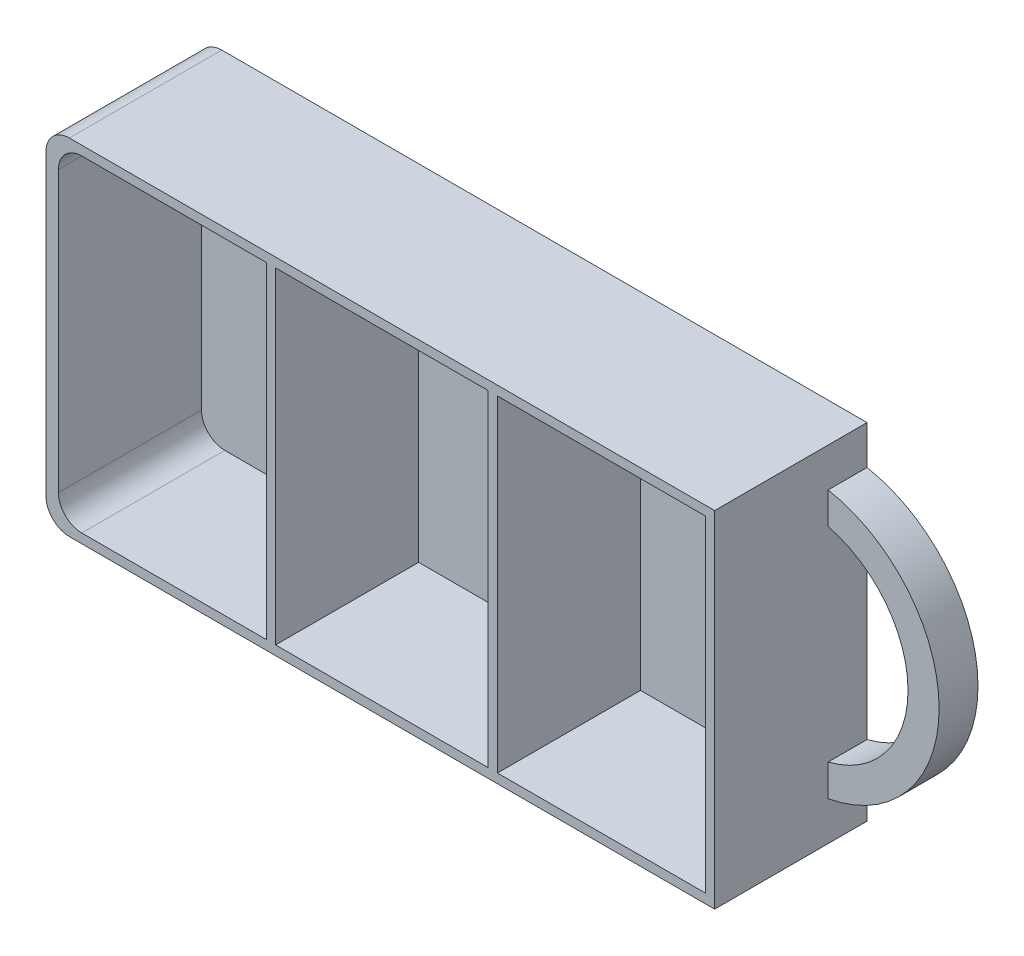
ISO-10303-21;
HEADER;
FILE_DESCRIPTION(('STEP AP214'),'2;1');
FILE_NAME('part.step','',(''),(''),'','','');
FILE_SCHEMA(('AUTOMOTIVE_DESIGN { 1 0 10303 214 1 1 1 1 }'));
ENDSEC;
DATA;
#1=APPLICATION_CONTEXT('core data for automotive mechanical design processes');
#2=APPLICATION_PROTOCOL_DEFINITION('international standard','automotive_design',2000,#1);
#3=PRODUCT_CONTEXT('',#1,'mechanical');
#4=PRODUCT('Part','Part','',(#3));
#5=PRODUCT_RELATED_PRODUCT_CATEGORY('part','',(#4));
#6=PRODUCT_DEFINITION_FORMATION('','',#4);
#7=PRODUCT_DEFINITION_CONTEXT('part definition',#1,'design');
#8=PRODUCT_DEFINITION('design','',#6,#7);
#9=PRODUCT_DEFINITION_SHAPE('','',#8);
#10=(LENGTH_UNIT() NAMED_UNIT(*) SI_UNIT(.MILLI.,.METRE.));
#11=(NAMED_UNIT(*) PLANE_ANGLE_UNIT() SI_UNIT($,.RADIAN.));
#12=(NAMED_UNIT(*) SI_UNIT($,.STERADIAN.) SOLID_ANGLE_UNIT());
#13=UNCERTAINTY_MEASURE_WITH_UNIT(LENGTH_MEASURE(1.E-05),#10,'distance_accuracy_value','');
#14=(GEOMETRIC_REPRESENTATION_CONTEXT(3) GLOBAL_UNCERTAINTY_ASSIGNED_CONTEXT((#13)) GLOBAL_UNIT_ASSIGNED_CONTEXT((#10,
#11,#12)) REPRESENTATION_CONTEXT('',''));
#15=CARTESIAN_POINT('',(0.,0.,0.));
#16=DIRECTION('',(0.,0.,1.));
#17=DIRECTION('',(1.,0.,0.));
#18=AXIS2_PLACEMENT_3D('',#15,#16,#17);
#19=CARTESIAN_POINT('',(0.,0.,19.6));
#20=DIRECTION('',(0.,0.,1.));
#21=DIRECTION('',(1.,0.,0.));
#22=AXIS2_PLACEMENT_3D('',#19,#20,#21);
#23=PLANE('',#22);
#24=DIRECTION('',(-1.,0.,0.));
#25=VECTOR('',#24,1.);
#26=CARTESIAN_POINT('',(0.,21.,19.6));
#27=LINE('',#26,#25);
#28=CARTESIAN_POINT('',(-14.6666666666667,21.,19.6));
#29=VERTEX_POINT('',#28);
#30=CARTESIAN_POINT('',(-38.4,21.,19.6));
#31=VERTEX_POINT('',#30);
#32=EDGE_CURVE('E227',#29,#31,#27,.T.);
#33=ORIENTED_EDGE('',*,*,#32,.F.);
#34=DIRECTION('',(0.,1.,0.));
#35=VECTOR('',#34,1.);
#36=CARTESIAN_POINT('',(-14.6666666666667,0.,19.6));
#37=LINE('',#36,#35);
#38=CARTESIAN_POINT('',(-14.6666666666667,-21.,19.6));
#39=VERTEX_POINT('',#38);
#40=EDGE_CURVE('E213',#39,#29,#37,.T.);
#41=ORIENTED_EDGE('',*,*,#40,.F.);
#42=DIRECTION('',(1.,0.,0.));
#43=VECTOR('',#42,1.);
#44=CARTESIAN_POINT('',(0.,-21.,19.6));
#45=LINE('',#44,#43);
#46=CARTESIAN_POINT('',(-38.4,-21.,19.6));
#47=VERTEX_POINT('',#46);
#48=EDGE_CURVE('E204',#47,#39,#45,.T.);
#49=ORIENTED_EDGE('',*,*,#48,.F.);
#50=CARTESIAN_POINT('',(-38.4,-18.,19.6));
#51=DIRECTION('',(0.,0.,1.));
#52=DIRECTION('',(1.,0.,0.));
#53=AXIS2_PLACEMENT_3D('',#50,#51,#52);
#54=CIRCLE('',#53,3.);
#55=CARTESIAN_POINT('',(-41.4,-18.,19.6));
#56=VERTEX_POINT('',#55);
#57=EDGE_CURVE('E49',#47,#56,#54,.F.);
#58=ORIENTED_EDGE('',*,*,#57,.T.);
#59=DIRECTION('',(0.,-1.,0.));
#60=VECTOR('',#59,1.);
#61=CARTESIAN_POINT('',(-41.4,0.,19.6));
#62=LINE('',#61,#60);
#63=CARTESIAN_POINT('',(-41.4,18.,19.6));
#64=VERTEX_POINT('',#63);
#65=EDGE_CURVE('E214',#64,#56,#62,.T.);
#66=ORIENTED_EDGE('',*,*,#65,.F.);
#67=CARTESIAN_POINT('',(-38.4,18.,19.6));
#68=DIRECTION('',(0.,0.,1.));
#69=DIRECTION('',(1.,0.,0.));
#70=AXIS2_PLACEMENT_3D('',#67,#68,#69);
#71=CIRCLE('',#70,3.);
#72=EDGE_CURVE('E12',#64,#31,#71,.F.);
#73=ORIENTED_EDGE('',*,*,#72,.T.);
#74=EDGE_LOOP('',(#33,#41,#49,#58,#66,#73));
#75=FACE_BOUND('',#74,.T.);
#76=DIRECTION('',(-1.,0.,0.));
#77=VECTOR('',#76,1.);
#78=CARTESIAN_POINT('',(0.,21.,19.6));
#79=LINE('',#78,#77);
#80=CARTESIAN_POINT('',(41.8,21.,19.6));
#81=VERTEX_POINT('',#80);
#82=CARTESIAN_POINT('',(15.0666666666667,21.,19.6));
#83=VERTEX_POINT('',#82);
#84=EDGE_CURVE('E276',#81,#83,#79,.T.);
#85=ORIENTED_EDGE('',*,*,#84,.F.);
#86=DIRECTION('',(0.,1.,0.));
#87=VECTOR('',#86,1.);
#88=CARTESIAN_POINT('',(41.8,0.,19.6));
#89=LINE('',#88,#87);
#90=CARTESIAN_POINT('',(41.8,-21.,19.6));
#91=VERTEX_POINT('',#90);
#92=EDGE_CURVE('E284',#91,#81,#89,.T.);
#93=ORIENTED_EDGE('',*,*,#92,.F.);
#94=DIRECTION('',(1.,0.,0.));
#95=VECTOR('',#94,1.);
#96=CARTESIAN_POINT('',(0.,-21.,19.6));
#97=LINE('',#96,#95);
#98=CARTESIAN_POINT('',(15.0666666666667,-21.,19.6));
#99=VERTEX_POINT('',#98);
#100=EDGE_CURVE('E281',#99,#91,#97,.T.);
#101=ORIENTED_EDGE('',*,*,#100,.F.);
#102=DIRECTION('',(0.,-1.,0.));
#103=VECTOR('',#102,1.);
#104=CARTESIAN_POINT('',(15.0666666666667,0.,19.6));
#105=LINE('',#104,#103);
#106=EDGE_CURVE('E278',#83,#99,#105,.T.);
#107=ORIENTED_EDGE('',*,*,#106,.F.);
#108=EDGE_LOOP('',(#85,#93,#101,#107));
#109=FACE_BOUND('',#108,.T.);
#110=DIRECTION('',(-1.,0.,0.));
#111=VECTOR('',#110,1.);
#112=CARTESIAN_POINT('',(-43.,22.2,19.6));
#113=LINE('',#112,#111);
#114=CARTESIAN_POINT('',(43.,22.2,19.6));
#115=VERTEX_POINT('',#114);
#116=CARTESIAN_POINT('',(-40.,22.2,19.6));
#117=VERTEX_POINT('',#116);
#118=EDGE_CURVE('E329',#115,#117,#113,.T.);
#119=ORIENTED_EDGE('',*,*,#118,.T.);
#120=CARTESIAN_POINT('',(-40.,19.2,19.6));
#121=DIRECTION('',(0.,0.,1.));
#122=DIRECTION('',(1.,0.,0.));
#123=AXIS2_PLACEMENT_3D('',#120,#121,#122);
#124=CIRCLE('',#123,3.);
#125=CARTESIAN_POINT('',(-43.,19.2,19.6));
#126=VERTEX_POINT('',#125);
#127=EDGE_CURVE('E367',#117,#126,#124,.T.);
#128=ORIENTED_EDGE('',*,*,#127,.T.);
#129=DIRECTION('',(0.,-1.,0.));
#130=VECTOR('',#129,1.);
#131=CARTESIAN_POINT('',(-43.,22.2,19.6));
#132=LINE('',#131,#130);
#133=CARTESIAN_POINT('',(-43.,-19.2,19.6));
#134=VERTEX_POINT('',#133);
#135=EDGE_CURVE('E333',#126,#134,#132,.T.);
#136=ORIENTED_EDGE('',*,*,#135,.T.);
#137=CARTESIAN_POINT('',(-40.,-19.2,19.6));
#138=DIRECTION('',(0.,0.,1.));
#139=DIRECTION('',(1.,0.,0.));
#140=AXIS2_PLACEMENT_3D('',#137,#138,#139);
#141=CIRCLE('',#140,3.);
#142=CARTESIAN_POINT('',(-40.,-22.2,19.6));
#143=VERTEX_POINT('',#142);
#144=EDGE_CURVE('E365',#134,#143,#141,.T.);
#145=ORIENTED_EDGE('',*,*,#144,.T.);
#146=DIRECTION('',(1.,0.,0.));
#147=VECTOR('',#146,1.);
#148=CARTESIAN_POINT('',(-43.,-22.2,19.6));
#149=LINE('',#148,#147);
#150=CARTESIAN_POINT('',(43.,-22.2,19.6));
#151=VERTEX_POINT('',#150);
#152=EDGE_CURVE('E336',#143,#151,#149,.T.);
#153=ORIENTED_EDGE('',*,*,#152,.T.);
#154=DIRECTION('',(0.,1.,0.));
#155=VECTOR('',#154,1.);
#156=CARTESIAN_POINT('',(43.,22.2,19.6));
#157=LINE('',#156,#155);
#158=EDGE_CURVE('E326',#151,#115,#157,.T.);
#159=ORIENTED_EDGE('',*,*,#158,.T.);
#160=EDGE_LOOP('',(#119,#128,#136,#145,#153,#159));
#161=FACE_BOUND('',#160,.T.);
#162=DIRECTION('',(-1.,0.,0.));
#163=VECTOR('',#162,1.);
#164=CARTESIAN_POINT('',(0.,21.,19.6));
#165=LINE('',#164,#163);
#166=CARTESIAN_POINT('',(13.8666666666667,21.,19.6));
#167=VERTEX_POINT('',#166);
#168=CARTESIAN_POINT('',(-13.4666666666667,21.,19.6));
#169=VERTEX_POINT('',#168);
#170=EDGE_CURVE('E250',#167,#169,#165,.T.);
#171=ORIENTED_EDGE('',*,*,#170,.F.);
#172=DIRECTION('',(0.,-1.,0.));
#173=VECTOR('',#172,1.);
#174=CARTESIAN_POINT('',(13.8666666666667,0.,19.6));
#175=LINE('',#174,#173);
#176=CARTESIAN_POINT('',(13.8666666666667,-21.,19.6));
#177=VERTEX_POINT('',#176);
#178=EDGE_CURVE('E247',#167,#177,#175,.T.);
#179=ORIENTED_EDGE('',*,*,#178,.T.);
#180=DIRECTION('',(1.,0.,0.));
#181=VECTOR('',#180,1.);
#182=CARTESIAN_POINT('',(0.,-21.,19.6));
#183=LINE('',#182,#181);
#184=CARTESIAN_POINT('',(-13.4666666666667,-21.,19.6));
#185=VERTEX_POINT('',#184);
#186=EDGE_CURVE('E257',#185,#177,#183,.T.);
#187=ORIENTED_EDGE('',*,*,#186,.F.);
#188=DIRECTION('',(0.,1.,0.));
#189=VECTOR('',#188,1.);
#190=CARTESIAN_POINT('',(-13.4666666666667,0.,19.6));
#191=LINE('',#190,#189);
#192=EDGE_CURVE('E254',#185,#169,#191,.T.);
#193=ORIENTED_EDGE('',*,*,#192,.T.);
#194=EDGE_LOOP('',(#171,#179,#187,#193));
#195=FACE_BOUND('',#194,.T.);
#196=ADVANCED_FACE('F41',(#75,#109,#161,#195),#23,.T.);
#197=CARTESIAN_POINT('',(43.,22.2,19.6));
#198=DIRECTION('',(-1.,0.,0.));
#199=DIRECTION('',(0.,-1.,0.));
#200=AXIS2_PLACEMENT_3D('',#197,#198,#199);
#201=PLANE('',#200);
#202=DIRECTION('',(0.,0.,-1.));
#203=VECTOR('',#202,1.);
#204=CARTESIAN_POINT('',(43.,-17.2,5.));
#205=LINE('',#204,#203);
#206=CARTESIAN_POINT('',(43.,-17.2,5.));
#207=VERTEX_POINT('',#206);
#208=CARTESIAN_POINT('',(43.,-17.2,0.));
#209=VERTEX_POINT('',#208);
#210=EDGE_CURVE('E309',#207,#209,#205,.T.);
#211=ORIENTED_EDGE('',*,*,#210,.F.);
#212=DIRECTION('',(0.,-1.,0.));
#213=VECTOR('',#212,1.);
#214=CARTESIAN_POINT('',(43.,-17.2,5.));
#215=LINE('',#214,#213);
#216=CARTESIAN_POINT('',(43.,-13.1087756865391,5.));
#217=VERTEX_POINT('',#216);
#218=EDGE_CURVE('E306',#217,#207,#215,.T.);
#219=ORIENTED_EDGE('',*,*,#218,.F.);
#220=DIRECTION('',(0.,0.,-1.));
#221=VECTOR('',#220,1.);
#222=CARTESIAN_POINT('',(43.,-13.1087756865391,5.));
#223=LINE('',#222,#221);
#224=CARTESIAN_POINT('',(43.,-13.1087756865391,0.));
#225=VERTEX_POINT('',#224);
#226=EDGE_CURVE('E316',#217,#225,#223,.T.);
#227=ORIENTED_EDGE('',*,*,#226,.T.);
#228=DIRECTION('',(0.,1.,0.));
#229=VECTOR('',#228,1.);
#230=CARTESIAN_POINT('',(43.,22.2,0.));
#231=LINE('',#230,#229);
#232=CARTESIAN_POINT('',(43.,13.1087756865391,0.));
#233=VERTEX_POINT('',#232);
#234=EDGE_CURVE('E342',#225,#233,#231,.T.);
#235=ORIENTED_EDGE('',*,*,#234,.T.);
#236=DIRECTION('',(0.,0.,-1.));
#237=VECTOR('',#236,1.);
#238=CARTESIAN_POINT('',(43.,13.1087756865391,5.));
#239=LINE('',#238,#237);
#240=CARTESIAN_POINT('',(43.,13.1087756865391,5.));
#241=VERTEX_POINT('',#240);
#242=EDGE_CURVE('E319',#241,#233,#239,.T.);
#243=ORIENTED_EDGE('',*,*,#242,.F.);
#244=DIRECTION('',(0.,-1.,0.));
#245=VECTOR('',#244,1.);
#246=CARTESIAN_POINT('',(43.,17.2,5.));
#247=LINE('',#246,#245);
#248=CARTESIAN_POINT('',(43.,17.2,5.));
#249=VERTEX_POINT('',#248);
#250=EDGE_CURVE('E299',#249,#241,#247,.T.);
#251=ORIENTED_EDGE('',*,*,#250,.F.);
#252=DIRECTION('',(0.,0.,-1.));
#253=VECTOR('',#252,1.);
#254=CARTESIAN_POINT('',(43.,17.2,5.));
#255=LINE('',#254,#253);
#256=CARTESIAN_POINT('',(43.,17.2,0.));
#257=VERTEX_POINT('',#256);
#258=EDGE_CURVE('E322',#249,#257,#255,.T.);
#259=ORIENTED_EDGE('',*,*,#258,.T.);
#260=CARTESIAN_POINT('',(43.,22.2,0.));
#261=VERTEX_POINT('',#260);
#262=EDGE_CURVE('E325',#257,#261,#231,.T.);
#263=ORIENTED_EDGE('',*,*,#262,.T.);
#264=DIRECTION('',(0.,0.,-1.));
#265=VECTOR('',#264,1.);
#266=CARTESIAN_POINT('',(43.,22.2,19.6));
#267=LINE('',#266,#265);
#268=EDGE_CURVE('E351',#115,#261,#267,.T.);
#269=ORIENTED_EDGE('',*,*,#268,.F.);
#270=ORIENTED_EDGE('',*,*,#158,.F.);
#271=DIRECTION('',(0.,0.,-1.));
#272=VECTOR('',#271,1.);
#273=CARTESIAN_POINT('',(43.,-22.2,19.6));
#274=LINE('',#273,#272);
#275=CARTESIAN_POINT('',(43.,-22.2,0.));
#276=VERTEX_POINT('',#275);
#277=EDGE_CURVE('E338',#151,#276,#274,.T.);
#278=ORIENTED_EDGE('',*,*,#277,.T.);
#279=EDGE_CURVE('E339',#276,#209,#231,.T.);
#280=ORIENTED_EDGE('',*,*,#279,.T.);
#281=EDGE_LOOP('',(#211,#219,#227,#235,#243,#251,#259,#263,#269,#270,#278,#280));
#282=FACE_BOUND('',#281,.T.);
#283=ADVANCED_FACE('F403',(#282),#201,.F.);
#284=CARTESIAN_POINT('',(-43.,22.2,19.6));
#285=DIRECTION('',(0.,-1.,0.));
#286=DIRECTION('',(0.,0.,-1.));
#287=AXIS2_PLACEMENT_3D('',#284,#285,#286);
#288=PLANE('',#287);
#289=DIRECTION('',(-1.,0.,0.));
#290=VECTOR('',#289,1.);
#291=CARTESIAN_POINT('',(-43.,22.2,0.));
#292=LINE('',#291,#290);
#293=CARTESIAN_POINT('',(-40.,22.2,0.));
#294=VERTEX_POINT('',#293);
#295=EDGE_CURVE('E341',#261,#294,#292,.T.);
#296=ORIENTED_EDGE('',*,*,#295,.T.);
#297=DIRECTION('',(0.,0.,-1.));
#298=VECTOR('',#297,1.);
#299=CARTESIAN_POINT('',(-40.,22.2,19.6));
#300=LINE('',#299,#298);
#301=EDGE_CURVE('E363',#294,#117,#300,.F.);
#302=ORIENTED_EDGE('',*,*,#301,.T.);
#303=ORIENTED_EDGE('',*,*,#118,.F.);
#304=ORIENTED_EDGE('',*,*,#268,.T.);
#305=EDGE_LOOP('',(#296,#302,#303,#304));
#306=FACE_BOUND('',#305,.T.);
#307=ADVANCED_FACE('F408',(#306),#288,.F.);
#308=CARTESIAN_POINT('',(-43.,22.2,19.6));
#309=DIRECTION('',(1.,0.,0.));
#310=DIRECTION('',(0.,1.,0.));
#311=AXIS2_PLACEMENT_3D('',#308,#309,#310);
#312=PLANE('',#311);
#313=ORIENTED_EDGE('',*,*,#135,.F.);
#314=DIRECTION('',(0.,0.,-1.));
#315=VECTOR('',#314,1.);
#316=CARTESIAN_POINT('',(-43.,19.2,19.6));
#317=LINE('',#316,#315);
#318=CARTESIAN_POINT('',(-43.,19.2,0.));
#319=VERTEX_POINT('',#318);
#320=EDGE_CURVE('E356',#126,#319,#317,.T.);
#321=ORIENTED_EDGE('',*,*,#320,.T.);
#322=DIRECTION('',(0.,-1.,0.));
#323=VECTOR('',#322,1.);
#324=CARTESIAN_POINT('',(-43.,22.2,0.));
#325=LINE('',#324,#323);
#326=CARTESIAN_POINT('',(-43.,-19.2,0.));
#327=VERTEX_POINT('',#326);
#328=EDGE_CURVE('E345',#319,#327,#325,.T.);
#329=ORIENTED_EDGE('',*,*,#328,.T.);
#330=DIRECTION('',(0.,0.,-1.));
#331=VECTOR('',#330,1.);
#332=CARTESIAN_POINT('',(-43.,-19.2,19.6));
#333=LINE('',#332,#331);
#334=EDGE_CURVE('E354',#327,#134,#333,.F.);
#335=ORIENTED_EDGE('',*,*,#334,.T.);
#336=EDGE_LOOP('',(#313,#321,#329,#335));
#337=FACE_BOUND('',#336,.T.);
#338=ADVANCED_FACE('F422',(#337),#312,.F.);
#339=CARTESIAN_POINT('',(-43.,-22.2,19.6));
#340=DIRECTION('',(0.,1.,0.));
#341=DIRECTION('',(0.,0.,1.));
#342=AXIS2_PLACEMENT_3D('',#339,#340,#341);
#343=PLANE('',#342);
#344=ORIENTED_EDGE('',*,*,#152,.F.);
#345=DIRECTION('',(0.,0.,-1.));
#346=VECTOR('',#345,1.);
#347=CARTESIAN_POINT('',(-40.,-22.2,19.6));
#348=LINE('',#347,#346);
#349=CARTESIAN_POINT('',(-40.,-22.2,0.));
#350=VERTEX_POINT('',#349);
#351=EDGE_CURVE('E369',#143,#350,#348,.T.);
#352=ORIENTED_EDGE('',*,*,#351,.T.);
#353=DIRECTION('',(1.,0.,0.));
#354=VECTOR('',#353,1.);
#355=CARTESIAN_POINT('',(-43.,-22.2,0.));
#356=LINE('',#355,#354);
#357=EDGE_CURVE('E330',#350,#276,#356,.T.);
#358=ORIENTED_EDGE('',*,*,#357,.T.);
#359=ORIENTED_EDGE('',*,*,#277,.F.);
#360=EDGE_LOOP('',(#344,#352,#358,#359));
#361=FACE_BOUND('',#360,.T.);
#362=ADVANCED_FACE('F418',(#361),#343,.F.);
#363=CARTESIAN_POINT('',(0.,0.,0.));
#364=DIRECTION('',(0.,0.,1.));
#365=DIRECTION('',(1.,0.,0.));
#366=AXIS2_PLACEMENT_3D('',#363,#364,#365);
#367=PLANE('',#366);
#368=CARTESIAN_POINT('',(39.7735468390197,0.,0.));
#369=DIRECTION('',(0.,0.,-1.));
#370=DIRECTION('',(1.,0.,0.));
#371=AXIS2_PLACEMENT_3D('',#368,#369,#370);
#372=CIRCLE('',#371,13.5);
#373=EDGE_CURVE('E300',#233,#225,#372,.T.);
#374=ORIENTED_EDGE('',*,*,#373,.F.);
#375=ORIENTED_EDGE('',*,*,#234,.F.);
#376=EDGE_LOOP('',(#374,#375));
#377=FACE_BOUND('',#376,.T.);
#378=ORIENTED_EDGE('',*,*,#328,.F.);
#379=CARTESIAN_POINT('',(-40.,19.2,0.));
#380=DIRECTION('',(0.,0.,1.));
#381=DIRECTION('',(1.,0.,0.));
#382=AXIS2_PLACEMENT_3D('',#379,#380,#381);
#383=CIRCLE('',#382,3.);
#384=EDGE_CURVE('E361',#319,#294,#383,.F.);
#385=ORIENTED_EDGE('',*,*,#384,.T.);
#386=ORIENTED_EDGE('',*,*,#295,.F.);
#387=ORIENTED_EDGE('',*,*,#262,.F.);
#388=CARTESIAN_POINT('',(39.7735468390197,0.,0.));
#389=DIRECTION('',(0.,0.,1.));
#390=DIRECTION('',(1.,0.,0.));
#391=AXIS2_PLACEMENT_3D('',#388,#389,#390);
#392=CIRCLE('',#391,17.5);
#393=EDGE_CURVE('E235',#209,#257,#392,.T.);
#394=ORIENTED_EDGE('',*,*,#393,.F.);
#395=ORIENTED_EDGE('',*,*,#279,.F.);
#396=ORIENTED_EDGE('',*,*,#357,.F.);
#397=CARTESIAN_POINT('',(-40.,-19.2,0.));
#398=DIRECTION('',(0.,0.,1.));
#399=DIRECTION('',(1.,0.,0.));
#400=AXIS2_PLACEMENT_3D('',#397,#398,#399);
#401=CIRCLE('',#400,3.);
#402=EDGE_CURVE('E359',#350,#327,#401,.F.);
#403=ORIENTED_EDGE('',*,*,#402,.T.);
#404=EDGE_LOOP('',(#378,#385,#386,#387,#394,#395,#396,#403));
#405=FACE_BOUND('',#404,.T.);
#406=ADVANCED_FACE('F415',(#377,#405),#367,.F.);
#407=CARTESIAN_POINT('',(39.7735468390197,0.,5.));
#408=DIRECTION('',(0.,0.,-1.));
#409=DIRECTION('',(-1.,0.,0.));
#410=AXIS2_PLACEMENT_3D('',#407,#408,#409);
#411=CYLINDRICAL_SURFACE('',#410,17.5);
#412=ORIENTED_EDGE('',*,*,#393,.T.);
#413=ORIENTED_EDGE('',*,*,#258,.F.);
#414=CARTESIAN_POINT('',(39.7735468390197,0.,5.));
#415=DIRECTION('',(0.,0.,1.));
#416=DIRECTION('',(1.,0.,0.));
#417=AXIS2_PLACEMENT_3D('',#414,#415,#416);
#418=CIRCLE('',#417,17.5);
#419=EDGE_CURVE('E296',#207,#249,#418,.T.);
#420=ORIENTED_EDGE('',*,*,#419,.F.);
#421=ORIENTED_EDGE('',*,*,#210,.T.);
#422=EDGE_LOOP('',(#412,#413,#420,#421));
#423=FACE_BOUND('',#422,.T.);
#424=ADVANCED_FACE('F413',(#423),#411,.T.);
#425=CARTESIAN_POINT('',(39.7735468390197,0.,5.));
#426=DIRECTION('',(0.,0.,-1.));
#427=DIRECTION('',(-1.,0.,0.));
#428=AXIS2_PLACEMENT_3D('',#425,#426,#427);
#429=CYLINDRICAL_SURFACE('',#428,13.5);
#430=ORIENTED_EDGE('',*,*,#373,.T.);
#431=ORIENTED_EDGE('',*,*,#226,.F.);
#432=CARTESIAN_POINT('',(39.7735468390197,0.,5.));
#433=DIRECTION('',(0.,0.,-1.));
#434=DIRECTION('',(1.,0.,0.));
#435=AXIS2_PLACEMENT_3D('',#432,#433,#434);
#436=CIRCLE('',#435,13.5);
#437=EDGE_CURVE('E303',#241,#217,#436,.T.);
#438=ORIENTED_EDGE('',*,*,#437,.F.);
#439=ORIENTED_EDGE('',*,*,#242,.T.);
#440=EDGE_LOOP('',(#430,#431,#438,#439));
#441=FACE_BOUND('',#440,.T.);
#442=ADVANCED_FACE('F466',(#441),#429,.F.);
#443=CARTESIAN_POINT('',(39.7735468390197,0.,5.));
#444=DIRECTION('',(0.,0.,1.));
#445=DIRECTION('',(1.,0.,0.));
#446=AXIS2_PLACEMENT_3D('',#443,#444,#445);
#447=PLANE('',#446);
#448=ORIENTED_EDGE('',*,*,#419,.T.);
#449=ORIENTED_EDGE('',*,*,#250,.T.);
#450=ORIENTED_EDGE('',*,*,#437,.T.);
#451=ORIENTED_EDGE('',*,*,#218,.T.);
#452=EDGE_LOOP('',(#448,#449,#450,#451));
#453=FACE_BOUND('',#452,.T.);
#454=ADVANCED_FACE('F461',(#453),#447,.T.);
#455=CARTESIAN_POINT('',(0.,21.,-50.1109879279097));
#456=DIRECTION('',(0.,1.,0.));
#457=DIRECTION('',(0.,0.,1.));
#458=AXIS2_PLACEMENT_3D('',#455,#456,#457);
#459=PLANE('',#458);
#460=DIRECTION('',(1.,0.,0.));
#461=VECTOR('',#460,1.);
#462=CARTESIAN_POINT('',(0.,21.,1.2));
#463=LINE('',#462,#461);
#464=CARTESIAN_POINT('',(15.0666666666667,21.,1.2));
#465=VERTEX_POINT('',#464);
#466=CARTESIAN_POINT('',(41.8,21.,1.2));
#467=VERTEX_POINT('',#466);
#468=EDGE_CURVE('E274',#465,#467,#463,.T.);
#469=ORIENTED_EDGE('',*,*,#468,.T.);
#470=DIRECTION('',(0.,0.,1.));
#471=VECTOR('',#470,1.);
#472=CARTESIAN_POINT('',(41.8,21.,-50.1109879279097));
#473=LINE('',#472,#471);
#474=EDGE_CURVE('E272',#467,#81,#473,.T.);
#475=ORIENTED_EDGE('',*,*,#474,.T.);
#476=ORIENTED_EDGE('',*,*,#84,.T.);
#477=DIRECTION('',(0.,0.,1.));
#478=VECTOR('',#477,1.);
#479=CARTESIAN_POINT('',(15.0666666666667,21.,-50.1109879279097));
#480=LINE('',#479,#478);
#481=EDGE_CURVE('E287',#465,#83,#480,.T.);
#482=ORIENTED_EDGE('',*,*,#481,.F.);
#483=EDGE_LOOP('',(#469,#475,#476,#482));
#484=FACE_BOUND('',#483,.T.);
#485=ADVANCED_FACE('F472',(#484),#459,.F.);
#486=CARTESIAN_POINT('',(41.8,0.,-50.1109879279097));
#487=DIRECTION('',(1.,0.,0.));
#488=DIRECTION('',(0.,1.,0.));
#489=AXIS2_PLACEMENT_3D('',#486,#487,#488);
#490=PLANE('',#489);
#491=DIRECTION('',(0.,-1.,0.));
#492=VECTOR('',#491,1.);
#493=CARTESIAN_POINT('',(41.8,0.,1.2));
#494=LINE('',#493,#492);
#495=CARTESIAN_POINT('',(41.8,-21.,1.2));
#496=VERTEX_POINT('',#495);
#497=EDGE_CURVE('E271',#467,#496,#494,.T.);
#498=ORIENTED_EDGE('',*,*,#497,.T.);
#499=DIRECTION('',(0.,0.,1.));
#500=VECTOR('',#499,1.);
#501=CARTESIAN_POINT('',(41.8,-21.,-50.1109879279097));
#502=LINE('',#501,#500);
#503=EDGE_CURVE('E289',#496,#91,#502,.T.);
#504=ORIENTED_EDGE('',*,*,#503,.T.);
#505=ORIENTED_EDGE('',*,*,#92,.T.);
#506=ORIENTED_EDGE('',*,*,#474,.F.);
#507=EDGE_LOOP('',(#498,#504,#505,#506));
#508=FACE_BOUND('',#507,.T.);
#509=ADVANCED_FACE('F477',(#508),#490,.F.);
#510=CARTESIAN_POINT('',(0.,-21.,-50.1109879279097));
#511=DIRECTION('',(0.,-1.,0.));
#512=DIRECTION('',(0.,0.,-1.));
#513=AXIS2_PLACEMENT_3D('',#510,#511,#512);
#514=PLANE('',#513);
#515=DIRECTION('',(-1.,0.,0.));
#516=VECTOR('',#515,1.);
#517=CARTESIAN_POINT('',(0.,-21.,1.2));
#518=LINE('',#517,#516);
#519=CARTESIAN_POINT('',(15.0666666666667,-21.,1.2));
#520=VERTEX_POINT('',#519);
#521=EDGE_CURVE('E269',#496,#520,#518,.T.);
#522=ORIENTED_EDGE('',*,*,#521,.T.);
#523=DIRECTION('',(0.,0.,1.));
#524=VECTOR('',#523,1.);
#525=CARTESIAN_POINT('',(15.0666666666667,-21.,-50.1109879279097));
#526=LINE('',#525,#524);
#527=EDGE_CURVE('E291',#520,#99,#526,.T.);
#528=ORIENTED_EDGE('',*,*,#527,.T.);
#529=ORIENTED_EDGE('',*,*,#100,.T.);
#530=ORIENTED_EDGE('',*,*,#503,.F.);
#531=EDGE_LOOP('',(#522,#528,#529,#530));
#532=FACE_BOUND('',#531,.T.);
#533=ADVANCED_FACE('F483',(#532),#514,.F.);
#534=CARTESIAN_POINT('',(15.0666666666667,0.,-50.1109879279097));
#535=DIRECTION('',(-1.,0.,0.));
#536=DIRECTION('',(0.,0.,1.));
#537=AXIS2_PLACEMENT_3D('',#534,#535,#536);
#538=PLANE('',#537);
#539=DIRECTION('',(0.,1.,0.));
#540=VECTOR('',#539,1.);
#541=CARTESIAN_POINT('',(15.0666666666667,0.,1.2));
#542=LINE('',#541,#540);
#543=EDGE_CURVE('E251',#520,#465,#542,.T.);
#544=ORIENTED_EDGE('',*,*,#543,.T.);
#545=ORIENTED_EDGE('',*,*,#481,.T.);
#546=ORIENTED_EDGE('',*,*,#106,.T.);
#547=ORIENTED_EDGE('',*,*,#527,.F.);
#548=EDGE_LOOP('',(#544,#545,#546,#547));
#549=FACE_BOUND('',#548,.T.);
#550=ADVANCED_FACE('F479',(#549),#538,.F.);
#551=CARTESIAN_POINT('',(0.,0.,1.2));
#552=DIRECTION('',(0.,0.,1.));
#553=DIRECTION('',(1.,0.,0.));
#554=AXIS2_PLACEMENT_3D('',#551,#552,#553);
#555=PLANE('',#554);
#556=ORIENTED_EDGE('',*,*,#468,.F.);
#557=ORIENTED_EDGE('',*,*,#543,.F.);
#558=ORIENTED_EDGE('',*,*,#521,.F.);
#559=ORIENTED_EDGE('',*,*,#497,.F.);
#560=EDGE_LOOP('',(#556,#557,#558,#559));
#561=FACE_BOUND('',#560,.T.);
#562=ADVANCED_FACE('F482',(#561),#555,.T.);
#563=CARTESIAN_POINT('',(13.8666666666667,0.,-50.1109879279097));
#564=DIRECTION('',(-1.,0.,0.));
#565=DIRECTION('',(0.,0.,1.));
#566=AXIS2_PLACEMENT_3D('',#563,#564,#565);
#567=PLANE('',#566);
#568=DIRECTION('',(0.,0.,1.));
#569=VECTOR('',#568,1.);
#570=CARTESIAN_POINT('',(13.8666666666667,-21.,-50.1109879279097));
#571=LINE('',#570,#569);
#572=CARTESIAN_POINT('',(13.8666666666667,-21.,1.2));
#573=VERTEX_POINT('',#572);
#574=EDGE_CURVE('E241',#573,#177,#571,.T.);
#575=ORIENTED_EDGE('',*,*,#574,.T.);
#576=ORIENTED_EDGE('',*,*,#178,.F.);
#577=DIRECTION('',(0.,0.,1.));
#578=VECTOR('',#577,1.);
#579=CARTESIAN_POINT('',(13.8666666666667,21.,-50.1109879279097));
#580=LINE('',#579,#578);
#581=CARTESIAN_POINT('',(13.8666666666667,21.,1.2));
#582=VERTEX_POINT('',#581);
#583=EDGE_CURVE('E260',#582,#167,#580,.T.);
#584=ORIENTED_EDGE('',*,*,#583,.F.);
#585=DIRECTION('',(0.,1.,0.));
#586=VECTOR('',#585,1.);
#587=CARTESIAN_POINT('',(13.8666666666667,0.,1.2));
#588=LINE('',#587,#586);
#589=EDGE_CURVE('E243',#573,#582,#588,.T.);
#590=ORIENTED_EDGE('',*,*,#589,.F.);
#591=EDGE_LOOP('',(#575,#576,#584,#590));
#592=FACE_BOUND('',#591,.T.);
#593=ADVANCED_FACE('F493',(#592),#567,.T.);
#594=CARTESIAN_POINT('',(0.,-21.,-50.1109879279097));
#595=DIRECTION('',(0.,-1.,0.));
#596=DIRECTION('',(0.,0.,-1.));
#597=AXIS2_PLACEMENT_3D('',#594,#595,#596);
#598=PLANE('',#597);
#599=DIRECTION('',(-1.,0.,0.));
#600=VECTOR('',#599,1.);
#601=CARTESIAN_POINT('',(0.,-21.,1.2));
#602=LINE('',#601,#600);
#603=CARTESIAN_POINT('',(-13.4666666666667,-21.,1.2));
#604=VERTEX_POINT('',#603);
#605=EDGE_CURVE('E240',#573,#604,#602,.T.);
#606=ORIENTED_EDGE('',*,*,#605,.T.);
#607=DIRECTION('',(0.,0.,1.));
#608=VECTOR('',#607,1.);
#609=CARTESIAN_POINT('',(-13.4666666666667,-21.,-50.1109879279097));
#610=LINE('',#609,#608);
#611=EDGE_CURVE('E262',#604,#185,#610,.T.);
#612=ORIENTED_EDGE('',*,*,#611,.T.);
#613=ORIENTED_EDGE('',*,*,#186,.T.);
#614=ORIENTED_EDGE('',*,*,#574,.F.);
#615=EDGE_LOOP('',(#606,#612,#613,#614));
#616=FACE_BOUND('',#615,.T.);
#617=ADVANCED_FACE('F497',(#616),#598,.F.);
#618=CARTESIAN_POINT('',(-13.4666666666667,0.,-50.1109879279097));
#619=DIRECTION('',(1.,0.,0.));
#620=DIRECTION('',(0.,0.,-1.));
#621=AXIS2_PLACEMENT_3D('',#618,#619,#620);
#622=PLANE('',#621);
#623=DIRECTION('',(0.,0.,1.));
#624=VECTOR('',#623,1.);
#625=CARTESIAN_POINT('',(-13.4666666666667,21.,-50.1109879279097));
#626=LINE('',#625,#624);
#627=CARTESIAN_POINT('',(-13.4666666666667,21.,1.2));
#628=VERTEX_POINT('',#627);
#629=EDGE_CURVE('E264',#628,#169,#626,.T.);
#630=ORIENTED_EDGE('',*,*,#629,.T.);
#631=ORIENTED_EDGE('',*,*,#192,.F.);
#632=ORIENTED_EDGE('',*,*,#611,.F.);
#633=DIRECTION('',(0.,-1.,0.));
#634=VECTOR('',#633,1.);
#635=CARTESIAN_POINT('',(-13.4666666666667,0.,1.2));
#636=LINE('',#635,#634);
#637=EDGE_CURVE('E237',#628,#604,#636,.T.);
#638=ORIENTED_EDGE('',*,*,#637,.F.);
#639=EDGE_LOOP('',(#630,#631,#632,#638));
#640=FACE_BOUND('',#639,.T.);
#641=ADVANCED_FACE('F503',(#640),#622,.T.);
#642=CARTESIAN_POINT('',(0.,21.,-50.1109879279097));
#643=DIRECTION('',(0.,1.,0.));
#644=DIRECTION('',(0.,0.,1.));
#645=AXIS2_PLACEMENT_3D('',#642,#643,#644);
#646=PLANE('',#645);
#647=DIRECTION('',(1.,0.,0.));
#648=VECTOR('',#647,1.);
#649=CARTESIAN_POINT('',(0.,21.,1.2));
#650=LINE('',#649,#648);
#651=EDGE_CURVE('E246',#628,#582,#650,.T.);
#652=ORIENTED_EDGE('',*,*,#651,.T.);
#653=ORIENTED_EDGE('',*,*,#583,.T.);
#654=ORIENTED_EDGE('',*,*,#170,.T.);
#655=ORIENTED_EDGE('',*,*,#629,.F.);
#656=EDGE_LOOP('',(#652,#653,#654,#655));
#657=FACE_BOUND('',#656,.T.);
#658=ADVANCED_FACE('F499',(#657),#646,.F.);
#659=CARTESIAN_POINT('',(0.,0.,1.2));
#660=DIRECTION('',(0.,0.,1.));
#661=DIRECTION('',(1.,0.,0.));
#662=AXIS2_PLACEMENT_3D('',#659,#660,#661);
#663=PLANE('',#662);
#664=ORIENTED_EDGE('',*,*,#605,.F.);
#665=ORIENTED_EDGE('',*,*,#589,.T.);
#666=ORIENTED_EDGE('',*,*,#651,.F.);
#667=ORIENTED_EDGE('',*,*,#637,.T.);
#668=EDGE_LOOP('',(#664,#665,#666,#667));
#669=FACE_BOUND('',#668,.T.);
#670=ADVANCED_FACE('F502',(#669),#663,.T.);
#671=CARTESIAN_POINT('',(0.,21.,-50.1109879279097));
#672=DIRECTION('',(0.,1.,0.));
#673=DIRECTION('',(0.,0.,1.));
#674=AXIS2_PLACEMENT_3D('',#671,#672,#673);
#675=PLANE('',#674);
#676=ORIENTED_EDGE('',*,*,#32,.T.);
#677=DIRECTION('',(0.,0.,1.));
#678=VECTOR('',#677,1.);
#679=CARTESIAN_POINT('',(-38.4,21.,1.2));
#680=LINE('',#679,#678);
#681=CARTESIAN_POINT('',(-38.4,21.,1.2));
#682=VERTEX_POINT('',#681);
#683=EDGE_CURVE('E56',#31,#682,#680,.F.);
#684=ORIENTED_EDGE('',*,*,#683,.T.);
#685=DIRECTION('',(1.,0.,0.));
#686=VECTOR('',#685,1.);
#687=CARTESIAN_POINT('',(0.,21.,1.2));
#688=LINE('',#687,#686);
#689=CARTESIAN_POINT('',(-14.6666666666667,21.,1.2));
#690=VERTEX_POINT('',#689);
#691=EDGE_CURVE('E236',#682,#690,#688,.T.);
#692=ORIENTED_EDGE('',*,*,#691,.T.);
#693=DIRECTION('',(0.,0.,1.));
#694=VECTOR('',#693,1.);
#695=CARTESIAN_POINT('',(-14.6666666666667,21.,-50.1109879279097));
#696=LINE('',#695,#694);
#697=EDGE_CURVE('E224',#690,#29,#696,.T.);
#698=ORIENTED_EDGE('',*,*,#697,.T.);
#699=EDGE_LOOP('',(#676,#684,#692,#698));
#700=FACE_BOUND('',#699,.T.);
#701=ADVANCED_FACE('F395',(#700),#675,.F.);
#702=CARTESIAN_POINT('',(-14.6666666666667,0.,-50.1109879279097));
#703=DIRECTION('',(1.,0.,0.));
#704=DIRECTION('',(0.,0.,-1.));
#705=AXIS2_PLACEMENT_3D('',#702,#703,#704);
#706=PLANE('',#705);
#707=DIRECTION('',(0.,-1.,0.));
#708=VECTOR('',#707,1.);
#709=CARTESIAN_POINT('',(-14.6666666666667,0.,1.2));
#710=LINE('',#709,#708);
#711=CARTESIAN_POINT('',(-14.6666666666667,-21.,1.2));
#712=VERTEX_POINT('',#711);
#713=EDGE_CURVE('E222',#690,#712,#710,.T.);
#714=ORIENTED_EDGE('',*,*,#713,.T.);
#715=DIRECTION('',(0.,0.,1.));
#716=VECTOR('',#715,1.);
#717=CARTESIAN_POINT('',(-14.6666666666667,-21.,-50.1109879279097));
#718=LINE('',#717,#716);
#719=EDGE_CURVE('E208',#712,#39,#718,.T.);
#720=ORIENTED_EDGE('',*,*,#719,.T.);
#721=ORIENTED_EDGE('',*,*,#40,.T.);
#722=ORIENTED_EDGE('',*,*,#697,.F.);
#723=EDGE_LOOP('',(#714,#720,#721,#722));
#724=FACE_BOUND('',#723,.T.);
#725=ADVANCED_FACE('F218',(#724),#706,.F.);
#726=CARTESIAN_POINT('',(0.,-21.,-50.1109879279097));
#727=DIRECTION('',(0.,-1.,0.));
#728=DIRECTION('',(0.,0.,-1.));
#729=AXIS2_PLACEMENT_3D('',#726,#727,#728);
#730=PLANE('',#729);
#731=DIRECTION('',(-1.,0.,0.));
#732=VECTOR('',#731,1.);
#733=CARTESIAN_POINT('',(0.,-21.,1.2));
#734=LINE('',#733,#732);
#735=CARTESIAN_POINT('',(-38.4,-21.,1.2));
#736=VERTEX_POINT('',#735);
#737=EDGE_CURVE('E231',#712,#736,#734,.T.);
#738=ORIENTED_EDGE('',*,*,#737,.T.);
#739=DIRECTION('',(0.,0.,1.));
#740=VECTOR('',#739,1.);
#741=CARTESIAN_POINT('',(-38.4,-21.,19.6));
#742=LINE('',#741,#740);
#743=EDGE_CURVE('E210',#736,#47,#742,.T.);
#744=ORIENTED_EDGE('',*,*,#743,.T.);
#745=ORIENTED_EDGE('',*,*,#48,.T.);
#746=ORIENTED_EDGE('',*,*,#719,.F.);
#747=EDGE_LOOP('',(#738,#744,#745,#746));
#748=FACE_BOUND('',#747,.T.);
#749=ADVANCED_FACE('F207',(#748),#730,.F.);
#750=CARTESIAN_POINT('',(-41.4,0.,-50.1109879279097));
#751=DIRECTION('',(-1.,0.,0.));
#752=DIRECTION('',(0.,-1.,0.));
#753=AXIS2_PLACEMENT_3D('',#750,#751,#752);
#754=PLANE('',#753);
#755=ORIENTED_EDGE('',*,*,#65,.T.);
#756=DIRECTION('',(0.,0.,1.));
#757=VECTOR('',#756,1.);
#758=CARTESIAN_POINT('',(-41.4,-18.,1.2));
#759=LINE('',#758,#757);
#760=CARTESIAN_POINT('',(-41.4,-18.,1.2));
#761=VERTEX_POINT('',#760);
#762=EDGE_CURVE('E376',#56,#761,#759,.F.);
#763=ORIENTED_EDGE('',*,*,#762,.T.);
#764=DIRECTION('',(0.,1.,0.));
#765=VECTOR('',#764,1.);
#766=CARTESIAN_POINT('',(-41.4,0.,1.2));
#767=LINE('',#766,#765);
#768=CARTESIAN_POINT('',(-41.4,18.,1.2));
#769=VERTEX_POINT('',#768);
#770=EDGE_CURVE('E233',#761,#769,#767,.T.);
#771=ORIENTED_EDGE('',*,*,#770,.T.);
#772=DIRECTION('',(0.,0.,1.));
#773=VECTOR('',#772,1.);
#774=CARTESIAN_POINT('',(-41.4,18.,19.6));
#775=LINE('',#774,#773);
#776=EDGE_CURVE('E373',#769,#64,#775,.T.);
#777=ORIENTED_EDGE('',*,*,#776,.T.);
#778=EDGE_LOOP('',(#755,#763,#771,#777));
#779=FACE_BOUND('',#778,.T.);
#780=ADVANCED_FACE('F386',(#779),#754,.F.);
#781=CARTESIAN_POINT('',(0.,0.,1.2));
#782=DIRECTION('',(0.,0.,1.));
#783=DIRECTION('',(1.,0.,0.));
#784=AXIS2_PLACEMENT_3D('',#781,#782,#783);
#785=PLANE('',#784);
#786=ORIENTED_EDGE('',*,*,#770,.F.);
#787=CARTESIAN_POINT('',(-38.4,-18.,1.2));
#788=DIRECTION('',(0.,0.,1.));
#789=DIRECTION('',(1.,0.,0.));
#790=AXIS2_PLACEMENT_3D('',#787,#788,#789);
#791=CIRCLE('',#790,3.);
#792=EDGE_CURVE('E379',#761,#736,#791,.T.);
#793=ORIENTED_EDGE('',*,*,#792,.T.);
#794=ORIENTED_EDGE('',*,*,#737,.F.);
#795=ORIENTED_EDGE('',*,*,#713,.F.);
#796=ORIENTED_EDGE('',*,*,#691,.F.);
#797=CARTESIAN_POINT('',(-38.4,18.,1.2));
#798=DIRECTION('',(0.,0.,1.));
#799=DIRECTION('',(1.,0.,0.));
#800=AXIS2_PLACEMENT_3D('',#797,#798,#799);
#801=CIRCLE('',#800,3.);
#802=EDGE_CURVE('E63',#682,#769,#801,.T.);
#803=ORIENTED_EDGE('',*,*,#802,.T.);
#804=EDGE_LOOP('',(#786,#793,#794,#795,#796,#803));
#805=FACE_BOUND('',#804,.T.);
#806=ADVANCED_FACE('F390',(#805),#785,.T.);
#807=CARTESIAN_POINT('',(-40.,19.2,19.6));
#808=DIRECTION('',(0.,0.,-1.));
#809=DIRECTION('',(-1.,0.,0.));
#810=AXIS2_PLACEMENT_3D('',#807,#808,#809);
#811=CYLINDRICAL_SURFACE('',#810,3.);
#812=ORIENTED_EDGE('',*,*,#127,.F.);
#813=ORIENTED_EDGE('',*,*,#301,.F.);
#814=ORIENTED_EDGE('',*,*,#384,.F.);
#815=ORIENTED_EDGE('',*,*,#320,.F.);
#816=EDGE_LOOP('',(#812,#813,#814,#815));
#817=FACE_BOUND('',#816,.T.);
#818=ADVANCED_FACE('F430',(#817),#811,.T.);
#819=CARTESIAN_POINT('',(-40.,-19.2,19.6));
#820=DIRECTION('',(0.,0.,-1.));
#821=DIRECTION('',(-1.,0.,0.));
#822=AXIS2_PLACEMENT_3D('',#819,#820,#821);
#823=CYLINDRICAL_SURFACE('',#822,3.);
#824=ORIENTED_EDGE('',*,*,#144,.F.);
#825=ORIENTED_EDGE('',*,*,#334,.F.);
#826=ORIENTED_EDGE('',*,*,#402,.F.);
#827=ORIENTED_EDGE('',*,*,#351,.F.);
#828=EDGE_LOOP('',(#824,#825,#826,#827));
#829=FACE_BOUND('',#828,.T.);
#830=ADVANCED_FACE('F401',(#829),#823,.T.);
#831=CARTESIAN_POINT('',(-38.4,-18.,-50.1109879279097));
#832=DIRECTION('',(0.,0.,-1.));
#833=DIRECTION('',(-1.,0.,0.));
#834=AXIS2_PLACEMENT_3D('',#831,#832,#833);
#835=CYLINDRICAL_SURFACE('',#834,3.);
#836=ORIENTED_EDGE('',*,*,#792,.F.);
#837=ORIENTED_EDGE('',*,*,#762,.F.);
#838=ORIENTED_EDGE('',*,*,#57,.F.);
#839=ORIENTED_EDGE('',*,*,#743,.F.);
#840=EDGE_LOOP('',(#836,#837,#838,#839));
#841=FACE_BOUND('',#840,.T.);
#842=ADVANCED_FACE('F389',(#841),#835,.F.);
#843=CARTESIAN_POINT('',(-38.4,18.,-50.1109879279097));
#844=DIRECTION('',(0.,0.,-1.));
#845=DIRECTION('',(-1.,0.,0.));
#846=AXIS2_PLACEMENT_3D('',#843,#844,#845);
#847=CYLINDRICAL_SURFACE('',#846,3.);
#848=ORIENTED_EDGE('',*,*,#802,.F.);
#849=ORIENTED_EDGE('',*,*,#683,.F.);
#850=ORIENTED_EDGE('',*,*,#72,.F.);
#851=ORIENTED_EDGE('',*,*,#776,.F.);
#852=EDGE_LOOP('',(#848,#849,#850,#851));
#853=FACE_BOUND('',#852,.T.);
#854=ADVANCED_FACE('F43',(#853),#847,.F.);
#855=CLOSED_SHELL('',(#196,#283,#307,#338,#362,#406,#424,#442,#454,#485,#509,#533,#550,#562,
#593,#617,#641,#658,#670,#701,#725,#749,#780,#806,#818,#830,#842,#854));
#856=MANIFOLD_SOLID_BREP('B2',#855);
#857=ADVANCED_BREP_SHAPE_REPRESENTATION('',(#18,#856),#14);
#858=SHAPE_DEFINITION_REPRESENTATION(#9,#857);
ENDSEC;
END-ISO-10303-21;
